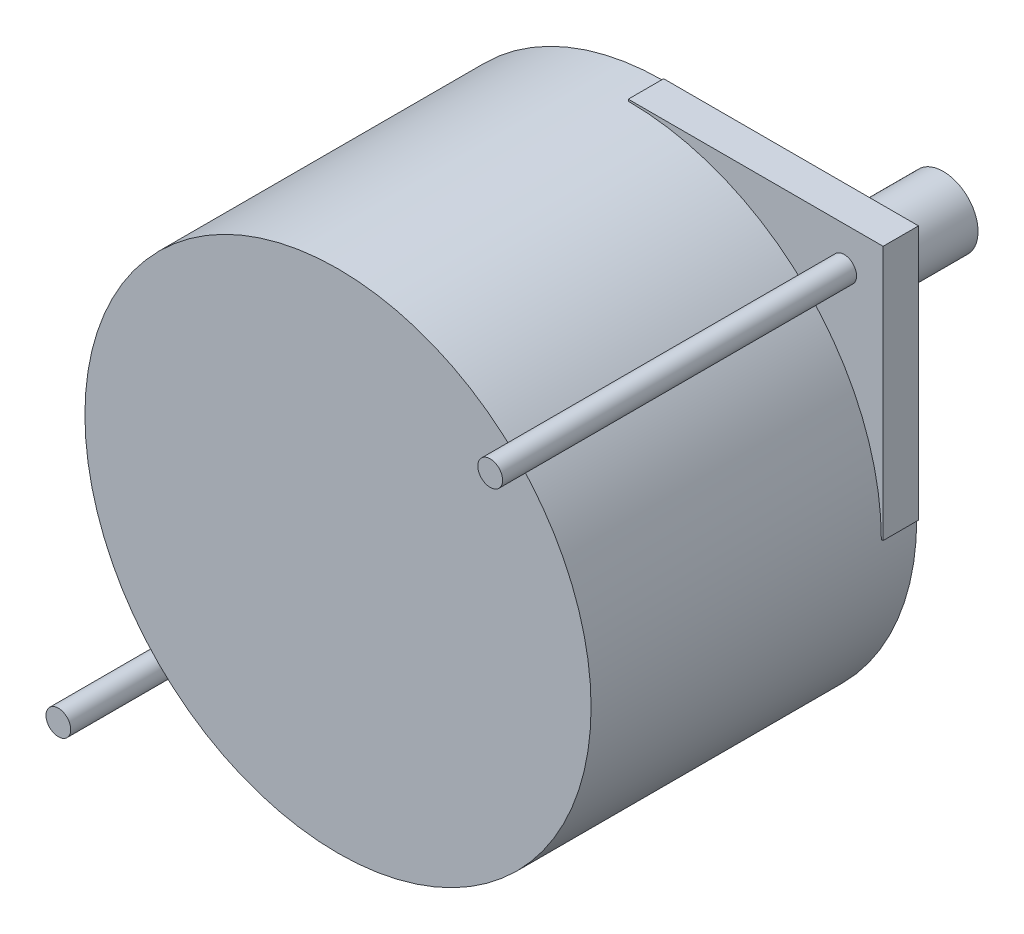
ISO-10303-21;
HEADER;
FILE_DESCRIPTION(('STEP AP214'),'2;1');
FILE_NAME('part.step','',(''),(''),'','','');
FILE_SCHEMA(('AUTOMOTIVE_DESIGN { 1 0 10303 214 1 1 1 1 }'));
ENDSEC;
DATA;
#1=APPLICATION_CONTEXT('core data for automotive mechanical design processes');
#2=APPLICATION_PROTOCOL_DEFINITION('international standard','automotive_design',2000,#1);
#3=PRODUCT_CONTEXT('',#1,'mechanical');
#4=PRODUCT('Part','Part','',(#3));
#5=PRODUCT_RELATED_PRODUCT_CATEGORY('part','',(#4));
#6=PRODUCT_DEFINITION_FORMATION('','',#4);
#7=PRODUCT_DEFINITION_CONTEXT('part definition',#1,'design');
#8=PRODUCT_DEFINITION('design','',#6,#7);
#9=PRODUCT_DEFINITION_SHAPE('','',#8);
#10=(LENGTH_UNIT() NAMED_UNIT(*) SI_UNIT(.MILLI.,.METRE.));
#11=(NAMED_UNIT(*) PLANE_ANGLE_UNIT() SI_UNIT($,.RADIAN.));
#12=(NAMED_UNIT(*) SI_UNIT($,.STERADIAN.) SOLID_ANGLE_UNIT());
#13=UNCERTAINTY_MEASURE_WITH_UNIT(LENGTH_MEASURE(1.E-05),#10,'distance_accuracy_value','');
#14=(GEOMETRIC_REPRESENTATION_CONTEXT(3) GLOBAL_UNCERTAINTY_ASSIGNED_CONTEXT((#13)) GLOBAL_UNIT_ASSIGNED_CONTEXT((#10,
#11,#12)) REPRESENTATION_CONTEXT('',''));
#15=CARTESIAN_POINT('',(0.,0.,0.));
#16=DIRECTION('',(0.,0.,1.));
#17=DIRECTION('',(1.,0.,0.));
#18=AXIS2_PLACEMENT_3D('',#15,#16,#17);
#19=CARTESIAN_POINT('',(0.,0.,2.54));
#20=DIRECTION('',(0.,0.,1.));
#21=DIRECTION('',(1.,0.,0.));
#22=AXIS2_PLACEMENT_3D('',#19,#20,#21);
#23=PLANE('',#22);
#24=CARTESIAN_POINT('',(2.15591616766473,-32.8378083832335,2.54));
#25=DIRECTION('',(0.,0.,1.));
#26=DIRECTION('',(1.,0.,0.));
#27=AXIS2_PLACEMENT_3D('',#24,#25,#26);
#28=CIRCLE('',#27,0.888999999999999);
#29=CARTESIAN_POINT('',(3.04491616766472,-32.8378083832335,2.54));
#30=VERTEX_POINT('',#29);
#31=EDGE_CURVE('E167',#30,#30,#28,.T.);
#32=ORIENTED_EDGE('',*,*,#31,.F.);
#33=EDGE_LOOP('',(#32));
#34=FACE_BOUND('',#33,.T.);
#35=DIRECTION('',(0.,-1.,0.));
#36=VECTOR('',#35,1.);
#37=CARTESIAN_POINT('',(17.6499161676647,-35.6318083832335,2.54));
#38=LINE('',#37,#36);
#39=CARTESIAN_POINT('',(17.6499161676647,-35.5048083832335,2.54));
#40=VERTEX_POINT('',#39);
#41=CARTESIAN_POINT('',(17.6499161676647,-35.6318083832335,2.54));
#42=VERTEX_POINT('',#41);
#43=EDGE_CURVE('E134',#40,#42,#38,.T.);
#44=ORIENTED_EDGE('',*,*,#43,.F.);
#45=CARTESIAN_POINT('',(17.6499161676647,-17.3438083832335,2.54));
#46=DIRECTION('',(0.,0.,1.));
#47=DIRECTION('',(1.,0.,0.));
#48=AXIS2_PLACEMENT_3D('',#45,#46,#47);
#49=CIRCLE('',#48,18.161);
#50=CARTESIAN_POINT('',(-0.511083832335335,-17.3438083832335,2.54));
#51=VERTEX_POINT('',#50);
#52=EDGE_CURVE('E122',#51,#40,#49,.T.);
#53=ORIENTED_EDGE('',*,*,#52,.F.);
#54=DIRECTION('',(1.,0.,0.));
#55=VECTOR('',#54,1.);
#56=CARTESIAN_POINT('',(-0.638083832335327,-17.3438083832335,2.54));
#57=LINE('',#56,#55);
#58=CARTESIAN_POINT('',(-0.638083832335327,-17.3438083832335,2.54));
#59=VERTEX_POINT('',#58);
#60=EDGE_CURVE('E149',#59,#51,#57,.T.);
#61=ORIENTED_EDGE('',*,*,#60,.F.);
#62=DIRECTION('',(0.,-1.,0.));
#63=VECTOR('',#62,1.);
#64=CARTESIAN_POINT('',(-0.638083832335329,0.944191616766467,2.54));
#65=LINE('',#64,#63);
#66=CARTESIAN_POINT('',(-0.638083832335325,-35.6318083832335,2.54));
#67=VERTEX_POINT('',#66);
#68=EDGE_CURVE('E185',#59,#67,#65,.T.);
#69=ORIENTED_EDGE('',*,*,#68,.T.);
#70=DIRECTION('',(1.,0.,0.));
#71=VECTOR('',#70,1.);
#72=CARTESIAN_POINT('',(-0.638083832335325,-35.6318083832335,2.54));
#73=LINE('',#72,#71);
#74=EDGE_CURVE('E187',#67,#42,#73,.T.);
#75=ORIENTED_EDGE('',*,*,#74,.T.);
#76=EDGE_LOOP('',(#44,#53,#61,#69,#75));
#77=FACE_BOUND('',#76,.T.);
#78=ADVANCED_FACE('F35',(#34,#77),#23,.T.);
#79=CARTESIAN_POINT('',(33.1439161676646,-1.84980838323354,2.54));
#80=DIRECTION('',(0.,0.,1.));
#81=DIRECTION('',(1.,0.,0.));
#82=AXIS2_PLACEMENT_3D('',#79,#80,#81);
#83=CIRCLE('',#82,0.889000000000003);
#84=CARTESIAN_POINT('',(34.0329161676646,-1.84980838323354,2.54));
#85=VERTEX_POINT('',#84);
#86=EDGE_CURVE('E176',#85,#85,#83,.T.);
#87=ORIENTED_EDGE('',*,*,#86,.F.);
#88=EDGE_LOOP('',(#87));
#89=FACE_BOUND('',#88,.T.);
#90=DIRECTION('',(0.,1.,0.));
#91=VECTOR('',#90,1.);
#92=CARTESIAN_POINT('',(17.6499161676647,0.944191616766467,2.54));
#93=LINE('',#92,#91);
#94=CARTESIAN_POINT('',(17.6499161676647,0.817191616766473,2.54));
#95=VERTEX_POINT('',#94);
#96=CARTESIAN_POINT('',(17.6499161676647,0.944191616766467,2.54));
#97=VERTEX_POINT('',#96);
#98=EDGE_CURVE('E119',#95,#97,#93,.T.);
#99=ORIENTED_EDGE('',*,*,#98,.F.);
#100=CARTESIAN_POINT('',(35.8109161676647,-17.3438083832335,2.54));
#101=VERTEX_POINT('',#100);
#102=EDGE_CURVE('E113',#101,#95,#49,.T.);
#103=ORIENTED_EDGE('',*,*,#102,.F.);
#104=DIRECTION('',(-1.,0.,0.));
#105=VECTOR('',#104,1.);
#106=CARTESIAN_POINT('',(35.9379161676647,-17.3438083832335,2.54));
#107=LINE('',#106,#105);
#108=CARTESIAN_POINT('',(35.9379161676647,-17.3438083832335,2.54));
#109=VERTEX_POINT('',#108);
#110=EDGE_CURVE('E116',#109,#101,#107,.T.);
#111=ORIENTED_EDGE('',*,*,#110,.F.);
#112=DIRECTION('',(0.,1.,0.));
#113=VECTOR('',#112,1.);
#114=CARTESIAN_POINT('',(35.9379161676647,0.944191616766467,2.54));
#115=LINE('',#114,#113);
#116=CARTESIAN_POINT('',(35.9379161676647,0.944191616766467,2.54));
#117=VERTEX_POINT('',#116);
#118=EDGE_CURVE('E191',#109,#117,#115,.T.);
#119=ORIENTED_EDGE('',*,*,#118,.T.);
#120=DIRECTION('',(-1.,0.,0.));
#121=VECTOR('',#120,1.);
#122=CARTESIAN_POINT('',(-0.638083832335329,0.944191616766467,2.54));
#123=LINE('',#122,#121);
#124=EDGE_CURVE('E193',#117,#97,#123,.T.);
#125=ORIENTED_EDGE('',*,*,#124,.T.);
#126=EDGE_LOOP('',(#99,#103,#111,#119,#125));
#127=FACE_BOUND('',#126,.T.);
#128=ADVANCED_FACE('F114',(#89,#127),#23,.T.);
#129=CARTESIAN_POINT('',(17.6499161676647,-17.3438083832335,-1.016));
#130=DIRECTION('',(0.,0.,-1.));
#131=DIRECTION('',(-1.,0.,0.));
#132=AXIS2_PLACEMENT_3D('',#129,#130,#131);
#133=PLANE('',#132);
#134=CARTESIAN_POINT('',(17.6499161676647,-17.3438083832335,-1.016));
#135=DIRECTION('',(0.,0.,-1.));
#136=DIRECTION('',(-1.,0.,0.));
#137=AXIS2_PLACEMENT_3D('',#134,#135,#136);
#138=CIRCLE('',#137,8.001);
#139=CARTESIAN_POINT('',(9.64891616766467,-17.3438083832335,-1.016));
#140=VERTEX_POINT('',#139);
#141=EDGE_CURVE('E135',#140,#140,#138,.T.);
#142=ORIENTED_EDGE('',*,*,#141,.T.);
#143=EDGE_LOOP('',(#142));
#144=FACE_BOUND('',#143,.T.);
#145=CARTESIAN_POINT('',(17.6499161676647,-17.3438083832335,-1.016));
#146=DIRECTION('',(0.,0.,-1.));
#147=DIRECTION('',(-1.,0.,0.));
#148=AXIS2_PLACEMENT_3D('',#145,#146,#147);
#149=CIRCLE('',#148,2.49555);
#150=CARTESIAN_POINT('',(15.1543661676647,-17.3438083832335,-1.016));
#151=VERTEX_POINT('',#150);
#152=EDGE_CURVE('E223',#151,#151,#149,.T.);
#153=ORIENTED_EDGE('',*,*,#152,.F.);
#154=EDGE_LOOP('',(#153));
#155=FACE_BOUND('',#154,.T.);
#156=ADVANCED_FACE('F252',(#144,#155),#133,.T.);
#157=CARTESIAN_POINT('',(0.,0.,0.));
#158=DIRECTION('',(0.,0.,1.));
#159=DIRECTION('',(1.,0.,0.));
#160=AXIS2_PLACEMENT_3D('',#157,#158,#159);
#161=PLANE('',#160);
#162=CARTESIAN_POINT('',(17.6499161676647,-17.3438083832335,0.));
#163=DIRECTION('',(0.,0.,-1.));
#164=DIRECTION('',(1.,0.,0.));
#165=AXIS2_PLACEMENT_3D('',#162,#163,#164);
#166=CIRCLE('',#165,18.161);
#167=CARTESIAN_POINT('',(35.8109161676647,-17.3438083832335,0.));
#168=VERTEX_POINT('',#167);
#169=CARTESIAN_POINT('',(17.6499161676647,-35.5048083832335,0.));
#170=VERTEX_POINT('',#169);
#171=EDGE_CURVE('E50',#168,#170,#166,.T.);
#172=ORIENTED_EDGE('',*,*,#171,.T.);
#173=DIRECTION('',(0.,-1.,0.));
#174=VECTOR('',#173,1.);
#175=CARTESIAN_POINT('',(17.6499161676647,-35.6318083832335,0.));
#176=LINE('',#175,#174);
#177=CARTESIAN_POINT('',(17.6499161676647,-35.6318083832335,0.));
#178=VERTEX_POINT('',#177);
#179=EDGE_CURVE('E143',#170,#178,#176,.T.);
#180=ORIENTED_EDGE('',*,*,#179,.T.);
#181=DIRECTION('',(1.,0.,0.));
#182=VECTOR('',#181,1.);
#183=CARTESIAN_POINT('',(-0.638083832335325,-35.6318083832335,0.));
#184=LINE('',#183,#182);
#185=CARTESIAN_POINT('',(-0.638083832335325,-35.6318083832335,0.));
#186=VERTEX_POINT('',#185);
#187=EDGE_CURVE('E197',#186,#178,#184,.T.);
#188=ORIENTED_EDGE('',*,*,#187,.F.);
#189=DIRECTION('',(0.,-1.,0.));
#190=VECTOR('',#189,1.);
#191=CARTESIAN_POINT('',(-0.638083832335329,0.944191616766467,0.));
#192=LINE('',#191,#190);
#193=CARTESIAN_POINT('',(-0.638083832335327,-17.3438083832335,0.));
#194=VERTEX_POINT('',#193);
#195=EDGE_CURVE('E182',#194,#186,#192,.T.);
#196=ORIENTED_EDGE('',*,*,#195,.F.);
#197=DIRECTION('',(1.,0.,0.));
#198=VECTOR('',#197,1.);
#199=CARTESIAN_POINT('',(-0.638083832335327,-17.3438083832335,0.));
#200=LINE('',#199,#198);
#201=CARTESIAN_POINT('',(-0.511083832335335,-17.3438083832335,0.));
#202=VERTEX_POINT('',#201);
#203=EDGE_CURVE('E153',#194,#202,#200,.T.);
#204=ORIENTED_EDGE('',*,*,#203,.T.);
#205=CARTESIAN_POINT('',(17.6499161676647,-17.3438083832335,0.));
#206=DIRECTION('',(0.,0.,-1.));
#207=DIRECTION('',(1.,0.,0.));
#208=AXIS2_PLACEMENT_3D('',#205,#206,#207);
#209=CIRCLE('',#208,18.161);
#210=CARTESIAN_POINT('',(17.6499161676647,0.817191616766473,0.));
#211=VERTEX_POINT('',#210);
#212=EDGE_CURVE('E57',#202,#211,#209,.T.);
#213=ORIENTED_EDGE('',*,*,#212,.T.);
#214=DIRECTION('',(0.,1.,0.));
#215=VECTOR('',#214,1.);
#216=CARTESIAN_POINT('',(17.6499161676647,0.944191616766467,0.));
#217=LINE('',#216,#215);
#218=CARTESIAN_POINT('',(17.6499161676647,0.944191616766467,0.));
#219=VERTEX_POINT('',#218);
#220=EDGE_CURVE('E157',#211,#219,#217,.T.);
#221=ORIENTED_EDGE('',*,*,#220,.T.);
#222=DIRECTION('',(-1.,0.,0.));
#223=VECTOR('',#222,1.);
#224=CARTESIAN_POINT('',(-0.638083832335329,0.944191616766467,0.));
#225=LINE('',#224,#223);
#226=CARTESIAN_POINT('',(35.9379161676647,0.944191616766467,0.));
#227=VERTEX_POINT('',#226);
#228=EDGE_CURVE('E188',#227,#219,#225,.T.);
#229=ORIENTED_EDGE('',*,*,#228,.F.);
#230=DIRECTION('',(0.,1.,0.));
#231=VECTOR('',#230,1.);
#232=CARTESIAN_POINT('',(35.9379161676647,0.944191616766467,0.));
#233=LINE('',#232,#231);
#234=CARTESIAN_POINT('',(35.9379161676647,-17.3438083832335,0.));
#235=VERTEX_POINT('',#234);
#236=EDGE_CURVE('E200',#235,#227,#233,.T.);
#237=ORIENTED_EDGE('',*,*,#236,.F.);
#238=DIRECTION('',(-1.,0.,0.));
#239=VECTOR('',#238,1.);
#240=CARTESIAN_POINT('',(35.9379161676647,-17.3438083832335,0.));
#241=LINE('',#240,#239);
#242=EDGE_CURVE('E137',#235,#168,#241,.T.);
#243=ORIENTED_EDGE('',*,*,#242,.T.);
#244=EDGE_LOOP('',(#172,#180,#188,#196,#204,#213,#221,#229,#237,#243));
#245=FACE_BOUND('',#244,.T.);
#246=CARTESIAN_POINT('',(17.6499161676647,-17.3438083832335,0.));
#247=DIRECTION('',(0.,0.,1.));
#248=DIRECTION('',(1.,0.,0.));
#249=AXIS2_PLACEMENT_3D('',#246,#247,#248);
#250=CIRCLE('',#249,8.001);
#251=CARTESIAN_POINT('',(25.6509161676647,-17.3438083832335,0.));
#252=VERTEX_POINT('',#251);
#253=EDGE_CURVE('E11',#252,#252,#250,.F.);
#254=ORIENTED_EDGE('',*,*,#253,.F.);
#255=EDGE_LOOP('',(#254));
#256=FACE_BOUND('',#255,.T.);
#257=ADVANCED_FACE('F217',(#245,#256),#161,.F.);
#258=CARTESIAN_POINT('',(-0.638083832335329,0.944191616766467,2.54));
#259=DIRECTION('',(1.,0.,0.));
#260=DIRECTION('',(0.,1.,0.));
#261=AXIS2_PLACEMENT_3D('',#258,#259,#260);
#262=PLANE('',#261);
#263=ORIENTED_EDGE('',*,*,#68,.F.);
#264=DIRECTION('',(0.,0.,1.));
#265=VECTOR('',#264,1.);
#266=CARTESIAN_POINT('',(-0.638083832335327,-17.3438083832335,0.));
#267=LINE('',#266,#265);
#268=EDGE_CURVE('E160',#194,#59,#267,.T.);
#269=ORIENTED_EDGE('',*,*,#268,.F.);
#270=ORIENTED_EDGE('',*,*,#195,.T.);
#271=DIRECTION('',(0.,0.,-1.));
#272=VECTOR('',#271,1.);
#273=CARTESIAN_POINT('',(-0.638083832335325,-35.6318083832335,2.54));
#274=LINE('',#273,#272);
#275=EDGE_CURVE('E43',#67,#186,#274,.T.);
#276=ORIENTED_EDGE('',*,*,#275,.F.);
#277=EDGE_LOOP('',(#263,#269,#270,#276));
#278=FACE_BOUND('',#277,.T.);
#279=ADVANCED_FACE('F37',(#278),#262,.F.);
#280=CARTESIAN_POINT('',(-0.638083832335325,-35.6318083832335,2.54));
#281=DIRECTION('',(0.,1.,0.));
#282=DIRECTION('',(0.,0.,1.));
#283=AXIS2_PLACEMENT_3D('',#280,#281,#282);
#284=PLANE('',#283);
#285=ORIENTED_EDGE('',*,*,#187,.T.);
#286=DIRECTION('',(0.,0.,1.));
#287=VECTOR('',#286,1.);
#288=CARTESIAN_POINT('',(17.6499161676647,-35.6318083832335,0.));
#289=LINE('',#288,#287);
#290=EDGE_CURVE('E146',#178,#42,#289,.T.);
#291=ORIENTED_EDGE('',*,*,#290,.T.);
#292=ORIENTED_EDGE('',*,*,#74,.F.);
#293=ORIENTED_EDGE('',*,*,#275,.T.);
#294=EDGE_LOOP('',(#285,#291,#292,#293));
#295=FACE_BOUND('',#294,.T.);
#296=ADVANCED_FACE('F209',(#295),#284,.F.);
#297=CARTESIAN_POINT('',(35.9379161676647,0.944191616766467,2.54));
#298=DIRECTION('',(-1.,0.,0.));
#299=DIRECTION('',(0.,-1.,0.));
#300=AXIS2_PLACEMENT_3D('',#297,#298,#299);
#301=PLANE('',#300);
#302=ORIENTED_EDGE('',*,*,#118,.F.);
#303=DIRECTION('',(0.,0.,1.));
#304=VECTOR('',#303,1.);
#305=CARTESIAN_POINT('',(35.9379161676647,-17.3438083832335,0.));
#306=LINE('',#305,#304);
#307=EDGE_CURVE('E130',#235,#109,#306,.T.);
#308=ORIENTED_EDGE('',*,*,#307,.F.);
#309=ORIENTED_EDGE('',*,*,#236,.T.);
#310=DIRECTION('',(0.,0.,-1.));
#311=VECTOR('',#310,1.);
#312=CARTESIAN_POINT('',(35.9379161676647,0.944191616766467,2.54));
#313=LINE('',#312,#311);
#314=EDGE_CURVE('E195',#117,#227,#313,.T.);
#315=ORIENTED_EDGE('',*,*,#314,.F.);
#316=EDGE_LOOP('',(#302,#308,#309,#315));
#317=FACE_BOUND('',#316,.T.);
#318=ADVANCED_FACE('F265',(#317),#301,.F.);
#319=CARTESIAN_POINT('',(-0.638083832335329,0.944191616766467,2.54));
#320=DIRECTION('',(0.,-1.,0.));
#321=DIRECTION('',(0.,0.,-1.));
#322=AXIS2_PLACEMENT_3D('',#319,#320,#321);
#323=PLANE('',#322);
#324=ORIENTED_EDGE('',*,*,#228,.T.);
#325=DIRECTION('',(0.,0.,1.));
#326=VECTOR('',#325,1.);
#327=CARTESIAN_POINT('',(17.6499161676647,0.944191616766467,0.));
#328=LINE('',#327,#326);
#329=EDGE_CURVE('E164',#219,#97,#328,.T.);
#330=ORIENTED_EDGE('',*,*,#329,.T.);
#331=ORIENTED_EDGE('',*,*,#124,.F.);
#332=ORIENTED_EDGE('',*,*,#314,.T.);
#333=EDGE_LOOP('',(#324,#330,#331,#332));
#334=FACE_BOUND('',#333,.T.);
#335=ADVANCED_FACE('F262',(#334),#323,.F.);
#336=CARTESIAN_POINT('',(33.1439161676646,-1.84980838323354,27.94));
#337=DIRECTION('',(0.,0.,-1.));
#338=DIRECTION('',(-1.,0.,0.));
#339=AXIS2_PLACEMENT_3D('',#336,#337,#338);
#340=CYLINDRICAL_SURFACE('',#339,0.889000000000003);
#341=CARTESIAN_POINT('',(33.1439161676646,-1.84980838323354,27.94));
#342=DIRECTION('',(0.,0.,1.));
#343=DIRECTION('',(1.,0.,0.));
#344=AXIS2_PLACEMENT_3D('',#341,#342,#343);
#345=CIRCLE('',#344,0.889000000000003);
#346=CARTESIAN_POINT('',(34.0329161676646,-1.84980838323354,27.94));
#347=VERTEX_POINT('',#346);
#348=EDGE_CURVE('E179',#347,#347,#345,.T.);
#349=ORIENTED_EDGE('',*,*,#348,.F.);
#350=EDGE_LOOP('',(#349));
#351=FACE_BOUND('',#350,.T.);
#352=ORIENTED_EDGE('',*,*,#86,.T.);
#353=EDGE_LOOP('',(#352));
#354=FACE_BOUND('',#353,.T.);
#355=ADVANCED_FACE('F258',(#351,#354),#340,.T.);
#356=CARTESIAN_POINT('',(33.1439161676646,-1.84980838323354,27.94));
#357=DIRECTION('',(0.,0.,1.));
#358=DIRECTION('',(1.,0.,0.));
#359=AXIS2_PLACEMENT_3D('',#356,#357,#358);
#360=PLANE('',#359);
#361=ORIENTED_EDGE('',*,*,#348,.T.);
#362=EDGE_LOOP('',(#361));
#363=FACE_BOUND('',#362,.T.);
#364=ADVANCED_FACE('F405',(#363),#360,.T.);
#365=CARTESIAN_POINT('',(2.15591616766473,-32.8378083832335,27.94));
#366=DIRECTION('',(0.,0.,-1.));
#367=DIRECTION('',(-1.,0.,0.));
#368=AXIS2_PLACEMENT_3D('',#365,#366,#367);
#369=CYLINDRICAL_SURFACE('',#368,0.888999999999999);
#370=CARTESIAN_POINT('',(2.15591616766473,-32.8378083832335,27.94));
#371=DIRECTION('',(0.,0.,1.));
#372=DIRECTION('',(1.,0.,0.));
#373=AXIS2_PLACEMENT_3D('',#370,#371,#372);
#374=CIRCLE('',#373,0.888999999999999);
#375=CARTESIAN_POINT('',(3.04491616766472,-32.8378083832335,27.94));
#376=VERTEX_POINT('',#375);
#377=EDGE_CURVE('E173',#376,#376,#374,.T.);
#378=ORIENTED_EDGE('',*,*,#377,.F.);
#379=EDGE_LOOP('',(#378));
#380=FACE_BOUND('',#379,.T.);
#381=ORIENTED_EDGE('',*,*,#31,.T.);
#382=EDGE_LOOP('',(#381));
#383=FACE_BOUND('',#382,.T.);
#384=ADVANCED_FACE('F398',(#380,#383),#369,.T.);
#385=CARTESIAN_POINT('',(2.15591616766473,-32.8378083832335,27.94));
#386=DIRECTION('',(0.,0.,1.));
#387=DIRECTION('',(1.,0.,0.));
#388=AXIS2_PLACEMENT_3D('',#385,#386,#387);
#389=PLANE('',#388);
#390=ORIENTED_EDGE('',*,*,#377,.T.);
#391=EDGE_LOOP('',(#390));
#392=FACE_BOUND('',#391,.T.);
#393=ADVANCED_FACE('F243',(#392),#389,.T.);
#394=CARTESIAN_POINT('',(17.6499161676647,0.944191616766467,0.));
#395=DIRECTION('',(1.,0.,0.));
#396=DIRECTION('',(0.,0.,-1.));
#397=AXIS2_PLACEMENT_3D('',#394,#395,#396);
#398=PLANE('',#397);
#399=ORIENTED_EDGE('',*,*,#98,.T.);
#400=ORIENTED_EDGE('',*,*,#329,.F.);
#401=ORIENTED_EDGE('',*,*,#220,.F.);
#402=DIRECTION('',(0.,0.,1.));
#403=VECTOR('',#402,1.);
#404=CARTESIAN_POINT('',(17.6499161676647,0.817191616766473,0.));
#405=LINE('',#404,#403);
#406=EDGE_CURVE('E168',#211,#95,#405,.T.);
#407=ORIENTED_EDGE('',*,*,#406,.T.);
#408=EDGE_LOOP('',(#399,#400,#401,#407));
#409=FACE_BOUND('',#408,.T.);
#410=ADVANCED_FACE('F234',(#409),#398,.F.);
#411=CARTESIAN_POINT('',(17.6499161676647,-17.3438083832335,0.));
#412=DIRECTION('',(0.,0.,1.));
#413=DIRECTION('',(1.,0.,0.));
#414=AXIS2_PLACEMENT_3D('',#411,#412,#413);
#415=CYLINDRICAL_SURFACE('',#414,18.161);
#416=DIRECTION('',(0.,0.,1.));
#417=VECTOR('',#416,1.);
#418=CARTESIAN_POINT('',(-0.511083832335335,-17.3438083832335,0.));
#419=LINE('',#418,#417);
#420=EDGE_CURVE('E170',#202,#51,#419,.T.);
#421=ORIENTED_EDGE('',*,*,#420,.T.);
#422=ORIENTED_EDGE('',*,*,#52,.T.);
#423=DIRECTION('',(0.,0.,1.));
#424=VECTOR('',#423,1.);
#425=CARTESIAN_POINT('',(17.6499161676647,-35.5048083832335,0.));
#426=LINE('',#425,#424);
#427=EDGE_CURVE('E129',#170,#40,#426,.T.);
#428=ORIENTED_EDGE('',*,*,#427,.F.);
#429=ORIENTED_EDGE('',*,*,#171,.F.);
#430=DIRECTION('',(0.,0.,1.));
#431=VECTOR('',#430,1.);
#432=CARTESIAN_POINT('',(35.8109161676647,-17.3438083832335,0.));
#433=LINE('',#432,#431);
#434=EDGE_CURVE('E124',#168,#101,#433,.T.);
#435=ORIENTED_EDGE('',*,*,#434,.T.);
#436=ORIENTED_EDGE('',*,*,#102,.T.);
#437=ORIENTED_EDGE('',*,*,#406,.F.);
#438=ORIENTED_EDGE('',*,*,#212,.F.);
#439=EDGE_LOOP('',(#421,#422,#428,#429,#435,#436,#437,#438));
#440=FACE_BOUND('',#439,.T.);
#441=CARTESIAN_POINT('',(17.6499161676647,-17.3438083832335,23.368));
#442=DIRECTION('',(0.,0.,1.));
#443=DIRECTION('',(1.,0.,0.));
#444=AXIS2_PLACEMENT_3D('',#441,#442,#443);
#445=CIRCLE('',#444,18.161);
#446=CARTESIAN_POINT('',(35.8109161676647,-17.3438083832335,23.368));
#447=VERTEX_POINT('',#446);
#448=EDGE_CURVE('E121',#447,#447,#445,.T.);
#449=ORIENTED_EDGE('',*,*,#448,.F.);
#450=EDGE_LOOP('',(#449));
#451=FACE_BOUND('',#450,.T.);
#452=ADVANCED_FACE('F125',(#440,#451),#415,.T.);
#453=CARTESIAN_POINT('',(-0.638083832335327,-17.3438083832335,0.));
#454=DIRECTION('',(0.,-1.,0.));
#455=DIRECTION('',(0.,0.,-1.));
#456=AXIS2_PLACEMENT_3D('',#453,#454,#455);
#457=PLANE('',#456);
#458=ORIENTED_EDGE('',*,*,#60,.T.);
#459=ORIENTED_EDGE('',*,*,#420,.F.);
#460=ORIENTED_EDGE('',*,*,#203,.F.);
#461=ORIENTED_EDGE('',*,*,#268,.T.);
#462=EDGE_LOOP('',(#458,#459,#460,#461));
#463=FACE_BOUND('',#462,.T.);
#464=ADVANCED_FACE('F233',(#463),#457,.F.);
#465=CARTESIAN_POINT('',(17.6499161676647,-35.6318083832335,0.));
#466=DIRECTION('',(-1.,0.,0.));
#467=DIRECTION('',(0.,-1.,0.));
#468=AXIS2_PLACEMENT_3D('',#465,#466,#467);
#469=PLANE('',#468);
#470=ORIENTED_EDGE('',*,*,#43,.T.);
#471=ORIENTED_EDGE('',*,*,#290,.F.);
#472=ORIENTED_EDGE('',*,*,#179,.F.);
#473=ORIENTED_EDGE('',*,*,#427,.T.);
#474=EDGE_LOOP('',(#470,#471,#472,#473));
#475=FACE_BOUND('',#474,.T.);
#476=ADVANCED_FACE('F240',(#475),#469,.F.);
#477=CARTESIAN_POINT('',(35.9379161676647,-17.3438083832335,0.));
#478=DIRECTION('',(0.,1.,0.));
#479=DIRECTION('',(0.,0.,1.));
#480=AXIS2_PLACEMENT_3D('',#477,#478,#479);
#481=PLANE('',#480);
#482=ORIENTED_EDGE('',*,*,#110,.T.);
#483=ORIENTED_EDGE('',*,*,#434,.F.);
#484=ORIENTED_EDGE('',*,*,#242,.F.);
#485=ORIENTED_EDGE('',*,*,#307,.T.);
#486=EDGE_LOOP('',(#482,#483,#484,#485));
#487=FACE_BOUND('',#486,.T.);
#488=ADVANCED_FACE('F132',(#487),#481,.F.);
#489=CARTESIAN_POINT('',(17.6499161676647,-17.3438083832335,-1.016));
#490=DIRECTION('',(0.,0.,1.));
#491=DIRECTION('',(1.,0.,0.));
#492=AXIS2_PLACEMENT_3D('',#489,#490,#491);
#493=CYLINDRICAL_SURFACE('',#492,8.001);
#494=ORIENTED_EDGE('',*,*,#141,.F.);
#495=EDGE_LOOP('',(#494));
#496=FACE_BOUND('',#495,.T.);
#497=ORIENTED_EDGE('',*,*,#253,.T.);
#498=EDGE_LOOP('',(#497));
#499=FACE_BOUND('',#498,.T.);
#500=ADVANCED_FACE('F336',(#496,#499),#493,.T.);
#501=CARTESIAN_POINT('',(17.6499161676647,-17.3438083832335,-20.066));
#502=DIRECTION('',(0.,0.,1.));
#503=DIRECTION('',(1.,0.,0.));
#504=AXIS2_PLACEMENT_3D('',#501,#502,#503);
#505=CYLINDRICAL_SURFACE('',#504,2.49555);
#506=CARTESIAN_POINT('',(17.6499161676647,-17.3438083832335,-20.066));
#507=DIRECTION('',(0.,0.,-1.));
#508=DIRECTION('',(-1.,0.,0.));
#509=AXIS2_PLACEMENT_3D('',#506,#507,#508);
#510=CIRCLE('',#509,2.49555);
#511=CARTESIAN_POINT('',(15.1543661676647,-17.3438083832335,-20.066));
#512=VERTEX_POINT('',#511);
#513=EDGE_CURVE('E140',#512,#512,#510,.T.);
#514=ORIENTED_EDGE('',*,*,#513,.F.);
#515=EDGE_LOOP('',(#514));
#516=FACE_BOUND('',#515,.T.);
#517=ORIENTED_EDGE('',*,*,#152,.T.);
#518=EDGE_LOOP('',(#517));
#519=FACE_BOUND('',#518,.T.);
#520=ADVANCED_FACE('F352',(#516,#519),#505,.T.);
#521=CARTESIAN_POINT('',(17.6499161676647,-17.3438083832335,-20.066));
#522=DIRECTION('',(0.,0.,-1.));
#523=DIRECTION('',(-1.,0.,0.));
#524=AXIS2_PLACEMENT_3D('',#521,#522,#523);
#525=PLANE('',#524);
#526=ORIENTED_EDGE('',*,*,#513,.T.);
#527=EDGE_LOOP('',(#526));
#528=FACE_BOUND('',#527,.T.);
#529=ADVANCED_FACE('F344',(#528),#525,.T.);
#530=CARTESIAN_POINT('',(17.6499161676647,-17.3438083832335,23.368));
#531=DIRECTION('',(0.,0.,1.));
#532=DIRECTION('',(1.,0.,0.));
#533=AXIS2_PLACEMENT_3D('',#530,#531,#532);
#534=PLANE('',#533);
#535=ORIENTED_EDGE('',*,*,#448,.T.);
#536=EDGE_LOOP('',(#535));
#537=FACE_BOUND('',#536,.T.);
#538=ADVANCED_FACE('F231',(#537),#534,.T.);
#539=CLOSED_SHELL('',(#78,#128,#156,#257,#279,#296,#318,#335,#355,#364,#384,#393,#410,#452,#464,
#476,#488,#500,#520,#529,#538));
#540=MANIFOLD_SOLID_BREP('B2',#539);
#541=ADVANCED_BREP_SHAPE_REPRESENTATION('',(#18,#540),#14);
#542=SHAPE_DEFINITION_REPRESENTATION(#9,#541);
ENDSEC;
END-ISO-10303-21;
